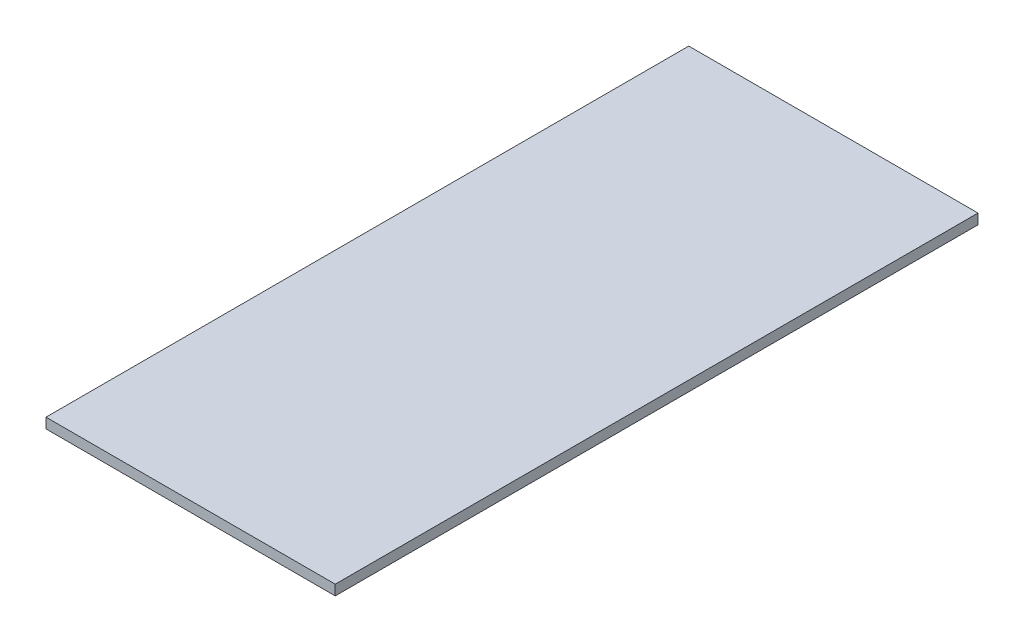
ISO-10303-21;
HEADER;
FILE_DESCRIPTION(('STEP AP214'),'2;1');
FILE_NAME('part.step','',(''),(''),'','','');
FILE_SCHEMA(('AUTOMOTIVE_DESIGN { 1 0 10303 214 1 1 1 1 }'));
ENDSEC;
DATA;
#1=APPLICATION_CONTEXT('core data for automotive mechanical design processes');
#2=APPLICATION_PROTOCOL_DEFINITION('international standard','automotive_design',2000,#1);
#3=PRODUCT_CONTEXT('',#1,'mechanical');
#4=PRODUCT('Part','Part','',(#3));
#5=PRODUCT_RELATED_PRODUCT_CATEGORY('part','',(#4));
#6=PRODUCT_DEFINITION_FORMATION('','',#4);
#7=PRODUCT_DEFINITION_CONTEXT('part definition',#1,'design');
#8=PRODUCT_DEFINITION('design','',#6,#7);
#9=PRODUCT_DEFINITION_SHAPE('','',#8);
#10=(LENGTH_UNIT() NAMED_UNIT(*) SI_UNIT(.MILLI.,.METRE.));
#11=(NAMED_UNIT(*) PLANE_ANGLE_UNIT() SI_UNIT($,.RADIAN.));
#12=(NAMED_UNIT(*) SI_UNIT($,.STERADIAN.) SOLID_ANGLE_UNIT());
#13=UNCERTAINTY_MEASURE_WITH_UNIT(LENGTH_MEASURE(1.E-05),#10,'distance_accuracy_value','');
#14=(GEOMETRIC_REPRESENTATION_CONTEXT(3) GLOBAL_UNCERTAINTY_ASSIGNED_CONTEXT((#13)) GLOBAL_UNIT_ASSIGNED_CONTEXT((#10,
#11,#12)) REPRESENTATION_CONTEXT('',''));
#15=CARTESIAN_POINT('',(0.,0.,0.));
#16=DIRECTION('',(0.,0.,1.));
#17=DIRECTION('',(1.,0.,0.));
#18=AXIS2_PLACEMENT_3D('',#15,#16,#17);
#19=CARTESIAN_POINT('',(0.,3.175,0.));
#20=DIRECTION('',(1.,0.,0.));
#21=DIRECTION('',(0.,0.,-1.));
#22=AXIS2_PLACEMENT_3D('',#19,#20,#21);
#23=PLANE('',#22);
#24=DIRECTION('',(0.,0.,1.));
#25=VECTOR('',#24,1.);
#26=CARTESIAN_POINT('',(0.,0.,0.));
#27=LINE('',#26,#25);
#28=CARTESIAN_POINT('',(0.,0.,-200.));
#29=VERTEX_POINT('',#28);
#30=CARTESIAN_POINT('',(0.,0.,0.));
#31=VERTEX_POINT('',#30);
#32=EDGE_CURVE('E96',#29,#31,#27,.T.);
#33=ORIENTED_EDGE('',*,*,#32,.T.);
#34=DIRECTION('',(0.,-1.,0.));
#35=VECTOR('',#34,1.);
#36=CARTESIAN_POINT('',(0.,3.175,0.));
#37=LINE('',#36,#35);
#38=CARTESIAN_POINT('',(0.,3.175,0.));
#39=VERTEX_POINT('',#38);
#40=EDGE_CURVE('E11',#39,#31,#37,.T.);
#41=ORIENTED_EDGE('',*,*,#40,.F.);
#42=DIRECTION('',(0.,0.,1.));
#43=VECTOR('',#42,1.);
#44=CARTESIAN_POINT('',(0.,3.175,0.));
#45=LINE('',#44,#43);
#46=CARTESIAN_POINT('',(0.,3.175,-200.));
#47=VERTEX_POINT('',#46);
#48=EDGE_CURVE('E84',#47,#39,#45,.T.);
#49=ORIENTED_EDGE('',*,*,#48,.F.);
#50=DIRECTION('',(0.,-1.,0.));
#51=VECTOR('',#50,1.);
#52=CARTESIAN_POINT('',(0.,3.175,-200.));
#53=LINE('',#52,#51);
#54=EDGE_CURVE('E92',#47,#29,#53,.T.);
#55=ORIENTED_EDGE('',*,*,#54,.T.);
#56=EDGE_LOOP('',(#33,#41,#49,#55));
#57=FACE_BOUND('',#56,.T.);
#58=ADVANCED_FACE('F33',(#57),#23,.F.);
#59=CARTESIAN_POINT('',(0.,3.175,0.));
#60=DIRECTION('',(0.,0.,-1.));
#61=DIRECTION('',(-1.,0.,0.));
#62=AXIS2_PLACEMENT_3D('',#59,#60,#61);
#63=PLANE('',#62);
#64=DIRECTION('',(1.,0.,0.));
#65=VECTOR('',#64,1.);
#66=CARTESIAN_POINT('',(0.,0.,0.));
#67=LINE('',#66,#65);
#68=CARTESIAN_POINT('',(90.,0.,0.));
#69=VERTEX_POINT('',#68);
#70=EDGE_CURVE('E88',#31,#69,#67,.T.);
#71=ORIENTED_EDGE('',*,*,#70,.T.);
#72=DIRECTION('',(0.,-1.,0.));
#73=VECTOR('',#72,1.);
#74=CARTESIAN_POINT('',(90.,3.175,0.));
#75=LINE('',#74,#73);
#76=CARTESIAN_POINT('',(90.,3.175,0.));
#77=VERTEX_POINT('',#76);
#78=EDGE_CURVE('E41',#77,#69,#75,.T.);
#79=ORIENTED_EDGE('',*,*,#78,.F.);
#80=DIRECTION('',(1.,0.,0.));
#81=VECTOR('',#80,1.);
#82=CARTESIAN_POINT('',(0.,3.175,0.));
#83=LINE('',#82,#81);
#84=EDGE_CURVE('E79',#39,#77,#83,.T.);
#85=ORIENTED_EDGE('',*,*,#84,.F.);
#86=ORIENTED_EDGE('',*,*,#40,.T.);
#87=EDGE_LOOP('',(#71,#79,#85,#86));
#88=FACE_BOUND('',#87,.T.);
#89=ADVANCED_FACE('F87',(#88),#63,.F.);
#90=CARTESIAN_POINT('',(90.,3.175,0.));
#91=DIRECTION('',(-1.,0.,0.));
#92=DIRECTION('',(0.,0.,1.));
#93=AXIS2_PLACEMENT_3D('',#90,#91,#92);
#94=PLANE('',#93);
#95=DIRECTION('',(0.,0.,-1.));
#96=VECTOR('',#95,1.);
#97=CARTESIAN_POINT('',(90.,0.,0.));
#98=LINE('',#97,#96);
#99=CARTESIAN_POINT('',(89.9999999999999,0.,-200.));
#100=VERTEX_POINT('',#99);
#101=EDGE_CURVE('E66',#69,#100,#98,.T.);
#102=ORIENTED_EDGE('',*,*,#101,.T.);
#103=DIRECTION('',(0.,-1.,0.));
#104=VECTOR('',#103,1.);
#105=CARTESIAN_POINT('',(89.9999999999999,3.175,-200.));
#106=LINE('',#105,#104);
#107=CARTESIAN_POINT('',(89.9999999999999,3.175,-200.));
#108=VERTEX_POINT('',#107);
#109=EDGE_CURVE('E89',#108,#100,#106,.T.);
#110=ORIENTED_EDGE('',*,*,#109,.F.);
#111=DIRECTION('',(0.,0.,-1.));
#112=VECTOR('',#111,1.);
#113=CARTESIAN_POINT('',(90.,3.175,0.));
#114=LINE('',#113,#112);
#115=EDGE_CURVE('E82',#77,#108,#114,.T.);
#116=ORIENTED_EDGE('',*,*,#115,.F.);
#117=ORIENTED_EDGE('',*,*,#78,.T.);
#118=EDGE_LOOP('',(#102,#110,#116,#117));
#119=FACE_BOUND('',#118,.T.);
#120=ADVANCED_FACE('F90',(#119),#94,.F.);
#121=CARTESIAN_POINT('',(0.,3.175,-200.));
#122=DIRECTION('',(0.,0.,1.));
#123=DIRECTION('',(1.,0.,0.));
#124=AXIS2_PLACEMENT_3D('',#121,#122,#123);
#125=PLANE('',#124);
#126=DIRECTION('',(-1.,0.,0.));
#127=VECTOR('',#126,1.);
#128=CARTESIAN_POINT('',(0.,0.,-200.));
#129=LINE('',#128,#127);
#130=EDGE_CURVE('E72',#100,#29,#129,.T.);
#131=ORIENTED_EDGE('',*,*,#130,.T.);
#132=ORIENTED_EDGE('',*,*,#54,.F.);
#133=DIRECTION('',(-1.,0.,0.));
#134=VECTOR('',#133,1.);
#135=CARTESIAN_POINT('',(0.,3.175,-200.));
#136=LINE('',#135,#134);
#137=EDGE_CURVE('E49',#108,#47,#136,.T.);
#138=ORIENTED_EDGE('',*,*,#137,.F.);
#139=ORIENTED_EDGE('',*,*,#109,.T.);
#140=EDGE_LOOP('',(#131,#132,#138,#139));
#141=FACE_BOUND('',#140,.T.);
#142=ADVANCED_FACE('F103',(#141),#125,.F.);
#143=CARTESIAN_POINT('',(0.,3.175,0.));
#144=DIRECTION('',(0.,-1.,0.));
#145=DIRECTION('',(0.,0.,-1.));
#146=AXIS2_PLACEMENT_3D('',#143,#144,#145);
#147=PLANE('',#146);
#148=ORIENTED_EDGE('',*,*,#48,.T.);
#149=ORIENTED_EDGE('',*,*,#84,.T.);
#150=ORIENTED_EDGE('',*,*,#115,.T.);
#151=ORIENTED_EDGE('',*,*,#137,.T.);
#152=EDGE_LOOP('',(#148,#149,#150,#151));
#153=FACE_BOUND('',#152,.T.);
#154=ADVANCED_FACE('F80',(#153),#147,.F.);
#155=CARTESIAN_POINT('',(0.,0.,0.));
#156=DIRECTION('',(0.,-1.,0.));
#157=DIRECTION('',(0.,0.,-1.));
#158=AXIS2_PLACEMENT_3D('',#155,#156,#157);
#159=PLANE('',#158);
#160=ORIENTED_EDGE('',*,*,#32,.F.);
#161=ORIENTED_EDGE('',*,*,#130,.F.);
#162=ORIENTED_EDGE('',*,*,#101,.F.);
#163=ORIENTED_EDGE('',*,*,#70,.F.);
#164=EDGE_LOOP('',(#160,#161,#162,#163));
#165=FACE_BOUND('',#164,.T.);
#166=ADVANCED_FACE('F106',(#165),#159,.T.);
#167=CLOSED_SHELL('',(#58,#89,#120,#142,#154,#166));
#168=MANIFOLD_SOLID_BREP('B2',#167);
#169=ADVANCED_BREP_SHAPE_REPRESENTATION('',(#18,#168),#14);
#170=SHAPE_DEFINITION_REPRESENTATION(#9,#169);
ENDSEC;
END-ISO-10303-21;
